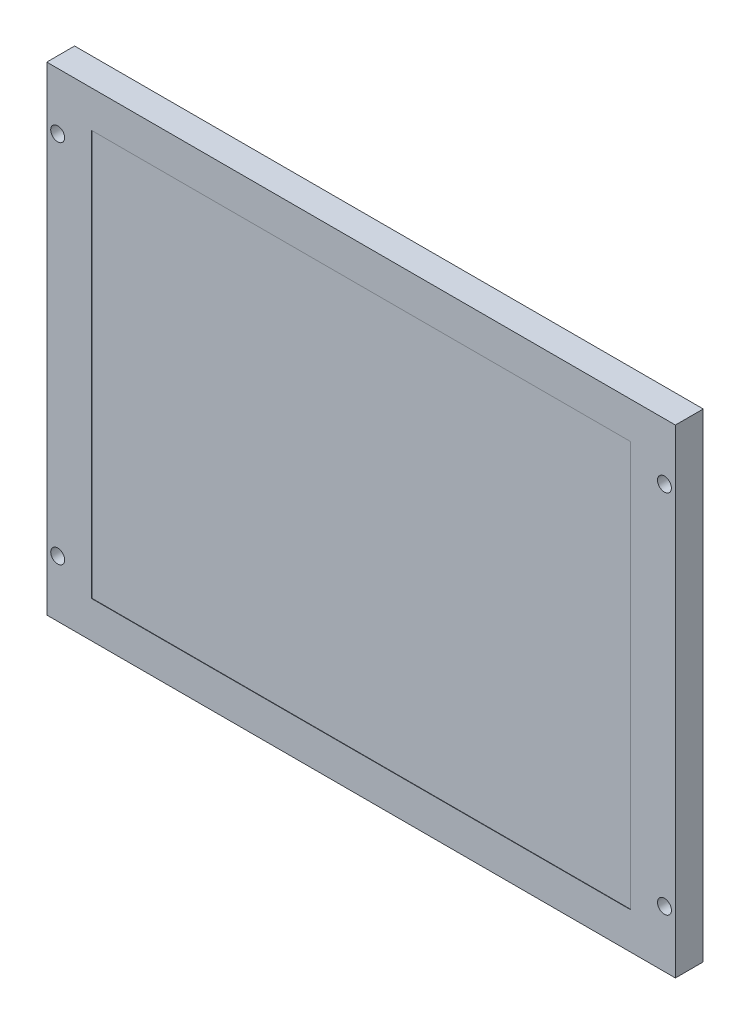
ISO-10303-21;
HEADER;
FILE_DESCRIPTION(('STEP AP214'),'2;1');
FILE_NAME('part.step','',(''),(''),'','','');
FILE_SCHEMA(('AUTOMOTIVE_DESIGN { 1 0 10303 214 1 1 1 1 }'));
ENDSEC;
DATA;
#1=APPLICATION_CONTEXT('core data for automotive mechanical design processes');
#2=APPLICATION_PROTOCOL_DEFINITION('international standard','automotive_design',2000,#1);
#3=PRODUCT_CONTEXT('',#1,'mechanical');
#4=PRODUCT('Part','Part','',(#3));
#5=PRODUCT_RELATED_PRODUCT_CATEGORY('part','',(#4));
#6=PRODUCT_DEFINITION_FORMATION('','',#4);
#7=PRODUCT_DEFINITION_CONTEXT('part definition',#1,'design');
#8=PRODUCT_DEFINITION('design','',#6,#7);
#9=PRODUCT_DEFINITION_SHAPE('','',#8);
#10=(LENGTH_UNIT() NAMED_UNIT(*) SI_UNIT(.MILLI.,.METRE.));
#11=(NAMED_UNIT(*) PLANE_ANGLE_UNIT() SI_UNIT($,.RADIAN.));
#12=(NAMED_UNIT(*) SI_UNIT($,.STERADIAN.) SOLID_ANGLE_UNIT());
#13=UNCERTAINTY_MEASURE_WITH_UNIT(LENGTH_MEASURE(1.E-05),#10,'distance_accuracy_value','');
#14=(GEOMETRIC_REPRESENTATION_CONTEXT(3) GLOBAL_UNCERTAINTY_ASSIGNED_CONTEXT((#13)) GLOBAL_UNIT_ASSIGNED_CONTEXT((#10,
#11,#12)) REPRESENTATION_CONTEXT('',''));
#15=CARTESIAN_POINT('',(0.,0.,0.));
#16=DIRECTION('',(0.,0.,1.));
#17=DIRECTION('',(1.,0.,0.));
#18=AXIS2_PLACEMENT_3D('',#15,#16,#17);
#19=CARTESIAN_POINT('',(0.,-120.36,0.));
#20=DIRECTION('',(0.,0.,1.));
#21=DIRECTION('',(1.,0.,0.));
#22=AXIS2_PLACEMENT_3D('',#19,#20,#21);
#23=PLANE('',#22);
#24=DIRECTION('',(0.,-1.,0.));
#25=VECTOR('',#24,1.);
#26=CARTESIAN_POINT('',(0.,0.,0.));
#27=LINE('',#26,#25);
#28=CARTESIAN_POINT('',(0.,0.,0.));
#29=VERTEX_POINT('',#28);
#30=CARTESIAN_POINT('',(0.,-120.36,0.));
#31=VERTEX_POINT('',#30);
#32=EDGE_CURVE('E191',#29,#31,#27,.T.);
#33=ORIENTED_EDGE('',*,*,#32,.F.);
#34=DIRECTION('',(-1.,0.,0.));
#35=VECTOR('',#34,1.);
#36=CARTESIAN_POINT('',(0.,0.,0.));
#37=LINE('',#36,#35);
#38=CARTESIAN_POINT('',(158.,0.,0.));
#39=VERTEX_POINT('',#38);
#40=EDGE_CURVE('E204',#39,#29,#37,.T.);
#41=ORIENTED_EDGE('',*,*,#40,.F.);
#42=DIRECTION('',(0.,1.,0.));
#43=VECTOR('',#42,1.);
#44=CARTESIAN_POINT('',(158.,0.,0.));
#45=LINE('',#44,#43);
#46=CARTESIAN_POINT('',(158.,-120.36,0.));
#47=VERTEX_POINT('',#46);
#48=EDGE_CURVE('E202',#47,#39,#45,.T.);
#49=ORIENTED_EDGE('',*,*,#48,.F.);
#50=DIRECTION('',(1.,0.,0.));
#51=VECTOR('',#50,1.);
#52=CARTESIAN_POINT('',(0.,-120.36,0.));
#53=LINE('',#52,#51);
#54=EDGE_CURVE('E200',#31,#47,#53,.T.);
#55=ORIENTED_EDGE('',*,*,#54,.F.);
#56=EDGE_LOOP('',(#33,#41,#49,#55));
#57=FACE_BOUND('',#56,.T.);
#58=CARTESIAN_POINT('',(155.25,-14.23,0.));
#59=DIRECTION('',(0.,0.,1.));
#60=DIRECTION('',(1.,0.,0.));
#61=AXIS2_PLACEMENT_3D('',#58,#59,#60);
#62=CIRCLE('',#61,1.75000000000001);
#63=CARTESIAN_POINT('',(157.,-14.23,0.));
#64=VERTEX_POINT('',#63);
#65=EDGE_CURVE('E164',#64,#64,#62,.T.);
#66=ORIENTED_EDGE('',*,*,#65,.T.);
#67=EDGE_LOOP('',(#66));
#68=FACE_BOUND('',#67,.T.);
#69=CARTESIAN_POINT('',(155.25,-106.13,0.));
#70=DIRECTION('',(0.,0.,1.));
#71=DIRECTION('',(1.,0.,0.));
#72=AXIS2_PLACEMENT_3D('',#69,#70,#71);
#73=CIRCLE('',#72,1.75000000000001);
#74=CARTESIAN_POINT('',(157.,-106.13,0.));
#75=VERTEX_POINT('',#74);
#76=EDGE_CURVE('E160',#75,#75,#73,.T.);
#77=ORIENTED_EDGE('',*,*,#76,.T.);
#78=EDGE_LOOP('',(#77));
#79=FACE_BOUND('',#78,.T.);
#80=CARTESIAN_POINT('',(2.75,-14.23,0.));
#81=DIRECTION('',(0.,0.,1.));
#82=DIRECTION('',(1.,0.,0.));
#83=AXIS2_PLACEMENT_3D('',#80,#81,#82);
#84=CIRCLE('',#83,1.75);
#85=CARTESIAN_POINT('',(4.5,-14.23,0.));
#86=VERTEX_POINT('',#85);
#87=EDGE_CURVE('E156',#86,#86,#84,.T.);
#88=ORIENTED_EDGE('',*,*,#87,.T.);
#89=EDGE_LOOP('',(#88));
#90=FACE_BOUND('',#89,.T.);
#91=CARTESIAN_POINT('',(2.74999999999999,-106.13,0.));
#92=DIRECTION('',(0.,0.,1.));
#93=DIRECTION('',(1.,0.,0.));
#94=AXIS2_PLACEMENT_3D('',#91,#92,#93);
#95=CIRCLE('',#94,1.75);
#96=CARTESIAN_POINT('',(4.49999999999999,-106.13,0.));
#97=VERTEX_POINT('',#96);
#98=EDGE_CURVE('E35',#97,#97,#95,.T.);
#99=ORIENTED_EDGE('',*,*,#98,.T.);
#100=EDGE_LOOP('',(#99));
#101=FACE_BOUND('',#100,.T.);
#102=DIRECTION('',(0.,-1.,0.));
#103=VECTOR('',#102,1.);
#104=CARTESIAN_POINT('',(142.57128982129,-75.8185081585081,0.));
#105=LINE('',#104,#103);
#106=CARTESIAN_POINT('',(142.57128982129,-75.8185081585081,0.));
#107=VERTEX_POINT('',#106);
#108=CARTESIAN_POINT('',(142.57128982129,-79.5014918414918,0.));
#109=VERTEX_POINT('',#108);
#110=EDGE_CURVE('E118',#107,#109,#105,.T.);
#111=ORIENTED_EDGE('',*,*,#110,.F.);
#112=DIRECTION('',(1.,0.,0.));
#113=VECTOR('',#112,1.);
#114=CARTESIAN_POINT('',(142.57128982129,-75.8185081585081,0.));
#115=LINE('',#114,#113);
#116=CARTESIAN_POINT('',(122.92871017871,-75.8185081585081,0.));
#117=VERTEX_POINT('',#116);
#118=EDGE_CURVE('E120',#117,#107,#115,.T.);
#119=ORIENTED_EDGE('',*,*,#118,.F.);
#120=DIRECTION('',(0.,1.,0.));
#121=VECTOR('',#120,1.);
#122=CARTESIAN_POINT('',(122.92871017871,-75.8185081585081,0.));
#123=LINE('',#122,#121);
#124=CARTESIAN_POINT('',(122.92871017871,-79.5014918414918,0.));
#125=VERTEX_POINT('',#124);
#126=EDGE_CURVE('E53',#125,#117,#123,.T.);
#127=ORIENTED_EDGE('',*,*,#126,.F.);
#128=DIRECTION('',(-1.,0.,0.));
#129=VECTOR('',#128,1.);
#130=CARTESIAN_POINT('',(142.57128982129,-79.5014918414918,0.));
#131=LINE('',#130,#129);
#132=EDGE_CURVE('E48',#109,#125,#131,.T.);
#133=ORIENTED_EDGE('',*,*,#132,.F.);
#134=EDGE_LOOP('',(#111,#119,#127,#133));
#135=FACE_BOUND('',#134,.T.);
#136=ADVANCED_FACE('F31',(#57,#68,#79,#90,#101,#135),#23,.F.);
#137=CARTESIAN_POINT('',(0.,0.,7.));
#138=DIRECTION('',(1.,0.,0.));
#139=DIRECTION('',(0.,1.,0.));
#140=AXIS2_PLACEMENT_3D('',#137,#138,#139);
#141=PLANE('',#140);
#142=ORIENTED_EDGE('',*,*,#32,.T.);
#143=DIRECTION('',(0.,0.,-1.));
#144=VECTOR('',#143,1.);
#145=CARTESIAN_POINT('',(0.,-120.36,7.));
#146=LINE('',#145,#144);
#147=CARTESIAN_POINT('',(0.,-120.36,7.));
#148=VERTEX_POINT('',#147);
#149=EDGE_CURVE('E11',#148,#31,#146,.T.);
#150=ORIENTED_EDGE('',*,*,#149,.F.);
#151=DIRECTION('',(0.,-1.,0.));
#152=VECTOR('',#151,1.);
#153=CARTESIAN_POINT('',(0.,0.,7.));
#154=LINE('',#153,#152);
#155=CARTESIAN_POINT('',(0.,0.,7.));
#156=VERTEX_POINT('',#155);
#157=EDGE_CURVE('E206',#156,#148,#154,.T.);
#158=ORIENTED_EDGE('',*,*,#157,.F.);
#159=DIRECTION('',(0.,0.,-1.));
#160=VECTOR('',#159,1.);
#161=CARTESIAN_POINT('',(0.,0.,7.));
#162=LINE('',#161,#160);
#163=EDGE_CURVE('E215',#156,#29,#162,.T.);
#164=ORIENTED_EDGE('',*,*,#163,.T.);
#165=EDGE_LOOP('',(#142,#150,#158,#164));
#166=FACE_BOUND('',#165,.T.);
#167=ADVANCED_FACE('F33',(#166),#141,.F.);
#168=CARTESIAN_POINT('',(0.,-120.36,7.));
#169=DIRECTION('',(0.,1.,0.));
#170=DIRECTION('',(0.,0.,1.));
#171=AXIS2_PLACEMENT_3D('',#168,#169,#170);
#172=PLANE('',#171);
#173=ORIENTED_EDGE('',*,*,#54,.T.);
#174=DIRECTION('',(0.,0.,-1.));
#175=VECTOR('',#174,1.);
#176=CARTESIAN_POINT('',(158.,-120.36,7.));
#177=LINE('',#176,#175);
#178=CARTESIAN_POINT('',(158.,-120.36,7.));
#179=VERTEX_POINT('',#178);
#180=EDGE_CURVE('E40',#179,#47,#177,.T.);
#181=ORIENTED_EDGE('',*,*,#180,.F.);
#182=DIRECTION('',(1.,0.,0.));
#183=VECTOR('',#182,1.);
#184=CARTESIAN_POINT('',(0.,-120.36,7.));
#185=LINE('',#184,#183);
#186=EDGE_CURVE('E209',#148,#179,#185,.T.);
#187=ORIENTED_EDGE('',*,*,#186,.F.);
#188=ORIENTED_EDGE('',*,*,#149,.T.);
#189=EDGE_LOOP('',(#173,#181,#187,#188));
#190=FACE_BOUND('',#189,.T.);
#191=ADVANCED_FACE('F252',(#190),#172,.F.);
#192=CARTESIAN_POINT('',(158.,0.,7.));
#193=DIRECTION('',(-1.,0.,0.));
#194=DIRECTION('',(0.,-1.,0.));
#195=AXIS2_PLACEMENT_3D('',#192,#193,#194);
#196=PLANE('',#195);
#197=ORIENTED_EDGE('',*,*,#48,.T.);
#198=DIRECTION('',(0.,0.,-1.));
#199=VECTOR('',#198,1.);
#200=CARTESIAN_POINT('',(158.,0.,7.));
#201=LINE('',#200,#199);
#202=CARTESIAN_POINT('',(158.,0.,7.));
#203=VERTEX_POINT('',#202);
#204=EDGE_CURVE('E218',#203,#39,#201,.T.);
#205=ORIENTED_EDGE('',*,*,#204,.F.);
#206=DIRECTION('',(0.,1.,0.));
#207=VECTOR('',#206,1.);
#208=CARTESIAN_POINT('',(158.,0.,7.));
#209=LINE('',#208,#207);
#210=EDGE_CURVE('E211',#179,#203,#209,.T.);
#211=ORIENTED_EDGE('',*,*,#210,.F.);
#212=ORIENTED_EDGE('',*,*,#180,.T.);
#213=EDGE_LOOP('',(#197,#205,#211,#212));
#214=FACE_BOUND('',#213,.T.);
#215=ADVANCED_FACE('F267',(#214),#196,.F.);
#216=CARTESIAN_POINT('',(0.,0.,7.));
#217=DIRECTION('',(0.,-1.,0.));
#218=DIRECTION('',(0.,0.,-1.));
#219=AXIS2_PLACEMENT_3D('',#216,#217,#218);
#220=PLANE('',#219);
#221=ORIENTED_EDGE('',*,*,#40,.T.);
#222=ORIENTED_EDGE('',*,*,#163,.F.);
#223=DIRECTION('',(-1.,0.,0.));
#224=VECTOR('',#223,1.);
#225=CARTESIAN_POINT('',(0.,0.,7.));
#226=LINE('',#225,#224);
#227=EDGE_CURVE('E213',#203,#156,#226,.T.);
#228=ORIENTED_EDGE('',*,*,#227,.F.);
#229=ORIENTED_EDGE('',*,*,#204,.T.);
#230=EDGE_LOOP('',(#221,#222,#228,#229));
#231=FACE_BOUND('',#230,.T.);
#232=ADVANCED_FACE('F263',(#231),#220,.F.);
#233=CARTESIAN_POINT('',(0.,-120.36,7.));
#234=DIRECTION('',(0.,0.,1.));
#235=DIRECTION('',(1.,0.,0.));
#236=AXIS2_PLACEMENT_3D('',#233,#234,#235);
#237=PLANE('',#236);
#238=CARTESIAN_POINT('',(2.74999999999999,-106.13,7.));
#239=DIRECTION('',(0.,0.,1.));
#240=DIRECTION('',(1.,0.,0.));
#241=AXIS2_PLACEMENT_3D('',#238,#239,#240);
#242=CIRCLE('',#241,1.75);
#243=CARTESIAN_POINT('',(4.49999999999999,-106.13,7.));
#244=VERTEX_POINT('',#243);
#245=EDGE_CURVE('E150',#244,#244,#242,.T.);
#246=ORIENTED_EDGE('',*,*,#245,.F.);
#247=EDGE_LOOP('',(#246));
#248=FACE_BOUND('',#247,.T.);
#249=CARTESIAN_POINT('',(2.75,-14.23,7.));
#250=DIRECTION('',(0.,0.,1.));
#251=DIRECTION('',(1.,0.,0.));
#252=AXIS2_PLACEMENT_3D('',#249,#250,#251);
#253=CIRCLE('',#252,1.75);
#254=CARTESIAN_POINT('',(4.5,-14.23,7.));
#255=VERTEX_POINT('',#254);
#256=EDGE_CURVE('E153',#255,#255,#253,.T.);
#257=ORIENTED_EDGE('',*,*,#256,.F.);
#258=EDGE_LOOP('',(#257));
#259=FACE_BOUND('',#258,.T.);
#260=CARTESIAN_POINT('',(155.25,-106.13,7.));
#261=DIRECTION('',(0.,0.,1.));
#262=DIRECTION('',(1.,0.,0.));
#263=AXIS2_PLACEMENT_3D('',#260,#261,#262);
#264=CIRCLE('',#263,1.75000000000001);
#265=CARTESIAN_POINT('',(157.,-106.13,7.));
#266=VERTEX_POINT('',#265);
#267=EDGE_CURVE('E157',#266,#266,#264,.T.);
#268=ORIENTED_EDGE('',*,*,#267,.F.);
#269=EDGE_LOOP('',(#268));
#270=FACE_BOUND('',#269,.T.);
#271=CARTESIAN_POINT('',(155.25,-14.23,7.));
#272=DIRECTION('',(0.,0.,1.));
#273=DIRECTION('',(1.,0.,0.));
#274=AXIS2_PLACEMENT_3D('',#271,#272,#273);
#275=CIRCLE('',#274,1.75000000000001);
#276=CARTESIAN_POINT('',(157.,-14.23,7.));
#277=VERTEX_POINT('',#276);
#278=EDGE_CURVE('E161',#277,#277,#275,.T.);
#279=ORIENTED_EDGE('',*,*,#278,.F.);
#280=EDGE_LOOP('',(#279));
#281=FACE_BOUND('',#280,.T.);
#282=DIRECTION('',(0.,-1.,0.));
#283=VECTOR('',#282,1.);
#284=CARTESIAN_POINT('',(11.27,-9.23,7.));
#285=LINE('',#284,#283);
#286=CARTESIAN_POINT('',(11.27,-9.23,7.));
#287=VERTEX_POINT('',#286);
#288=CARTESIAN_POINT('',(11.27,-111.13,7.));
#289=VERTEX_POINT('',#288);
#290=EDGE_CURVE('E165',#287,#289,#285,.T.);
#291=ORIENTED_EDGE('',*,*,#290,.F.);
#292=DIRECTION('',(-1.,0.,0.));
#293=VECTOR('',#292,1.);
#294=CARTESIAN_POINT('',(11.27,-9.23,7.));
#295=LINE('',#294,#293);
#296=CARTESIAN_POINT('',(146.73,-9.23,7.));
#297=VERTEX_POINT('',#296);
#298=EDGE_CURVE('E173',#297,#287,#295,.T.);
#299=ORIENTED_EDGE('',*,*,#298,.F.);
#300=DIRECTION('',(0.,1.,0.));
#301=VECTOR('',#300,1.);
#302=CARTESIAN_POINT('',(146.73,-9.23,7.));
#303=LINE('',#302,#301);
#304=CARTESIAN_POINT('',(146.73,-111.13,7.));
#305=VERTEX_POINT('',#304);
#306=EDGE_CURVE('E170',#305,#297,#303,.T.);
#307=ORIENTED_EDGE('',*,*,#306,.F.);
#308=DIRECTION('',(1.,0.,0.));
#309=VECTOR('',#308,1.);
#310=CARTESIAN_POINT('',(11.27,-111.13,7.));
#311=LINE('',#310,#309);
#312=EDGE_CURVE('E167',#289,#305,#311,.T.);
#313=ORIENTED_EDGE('',*,*,#312,.F.);
#314=EDGE_LOOP('',(#291,#299,#307,#313));
#315=FACE_BOUND('',#314,.T.);
#316=ORIENTED_EDGE('',*,*,#157,.T.);
#317=ORIENTED_EDGE('',*,*,#186,.T.);
#318=ORIENTED_EDGE('',*,*,#210,.T.);
#319=ORIENTED_EDGE('',*,*,#227,.T.);
#320=EDGE_LOOP('',(#316,#317,#318,#319));
#321=FACE_BOUND('',#320,.T.);
#322=ADVANCED_FACE('F260',(#248,#259,#270,#281,#315,#321),#237,.T.);
#323=CARTESIAN_POINT('',(11.27,-9.23,6.9));
#324=DIRECTION('',(-1.,0.,0.));
#325=DIRECTION('',(0.,-1.,0.));
#326=AXIS2_PLACEMENT_3D('',#323,#324,#325);
#327=PLANE('',#326);
#328=ORIENTED_EDGE('',*,*,#290,.T.);
#329=DIRECTION('',(0.,0.,1.));
#330=VECTOR('',#329,1.);
#331=CARTESIAN_POINT('',(11.27,-111.13,6.9));
#332=LINE('',#331,#330);
#333=CARTESIAN_POINT('',(11.27,-111.13,6.9));
#334=VERTEX_POINT('',#333);
#335=EDGE_CURVE('E188',#334,#289,#332,.T.);
#336=ORIENTED_EDGE('',*,*,#335,.F.);
#337=DIRECTION('',(0.,-1.,0.));
#338=VECTOR('',#337,1.);
#339=CARTESIAN_POINT('',(11.27,-9.23,6.9));
#340=LINE('',#339,#338);
#341=CARTESIAN_POINT('',(11.27,-9.23,6.9));
#342=VERTEX_POINT('',#341);
#343=EDGE_CURVE('E176',#342,#334,#340,.T.);
#344=ORIENTED_EDGE('',*,*,#343,.F.);
#345=DIRECTION('',(0.,0.,1.));
#346=VECTOR('',#345,1.);
#347=CARTESIAN_POINT('',(11.27,-9.23,6.9));
#348=LINE('',#347,#346);
#349=EDGE_CURVE('E189',#342,#287,#348,.T.);
#350=ORIENTED_EDGE('',*,*,#349,.T.);
#351=EDGE_LOOP('',(#328,#336,#344,#350));
#352=FACE_BOUND('',#351,.T.);
#353=ADVANCED_FACE('F258',(#352),#327,.F.);
#354=CARTESIAN_POINT('',(11.27,-9.23,6.9));
#355=DIRECTION('',(0.,1.,0.));
#356=DIRECTION('',(0.,0.,1.));
#357=AXIS2_PLACEMENT_3D('',#354,#355,#356);
#358=PLANE('',#357);
#359=ORIENTED_EDGE('',*,*,#298,.T.);
#360=ORIENTED_EDGE('',*,*,#349,.F.);
#361=DIRECTION('',(-1.,0.,0.));
#362=VECTOR('',#361,1.);
#363=CARTESIAN_POINT('',(11.27,-9.23,6.9));
#364=LINE('',#363,#362);
#365=CARTESIAN_POINT('',(146.73,-9.23,6.9));
#366=VERTEX_POINT('',#365);
#367=EDGE_CURVE('E185',#366,#342,#364,.T.);
#368=ORIENTED_EDGE('',*,*,#367,.F.);
#369=DIRECTION('',(0.,0.,1.));
#370=VECTOR('',#369,1.);
#371=CARTESIAN_POINT('',(146.73,-9.23,6.9));
#372=LINE('',#371,#370);
#373=EDGE_CURVE('E192',#366,#297,#372,.T.);
#374=ORIENTED_EDGE('',*,*,#373,.T.);
#375=EDGE_LOOP('',(#359,#360,#368,#374));
#376=FACE_BOUND('',#375,.T.);
#377=ADVANCED_FACE('F307',(#376),#358,.F.);
#378=CARTESIAN_POINT('',(146.73,-9.23,6.9));
#379=DIRECTION('',(1.,0.,0.));
#380=DIRECTION('',(0.,0.,-1.));
#381=AXIS2_PLACEMENT_3D('',#378,#379,#380);
#382=PLANE('',#381);
#383=ORIENTED_EDGE('',*,*,#306,.T.);
#384=ORIENTED_EDGE('',*,*,#373,.F.);
#385=DIRECTION('',(0.,1.,0.));
#386=VECTOR('',#385,1.);
#387=CARTESIAN_POINT('',(146.73,-9.23,6.9));
#388=LINE('',#387,#386);
#389=CARTESIAN_POINT('',(146.73,-111.13,6.9));
#390=VERTEX_POINT('',#389);
#391=EDGE_CURVE('E182',#390,#366,#388,.T.);
#392=ORIENTED_EDGE('',*,*,#391,.F.);
#393=DIRECTION('',(0.,0.,1.));
#394=VECTOR('',#393,1.);
#395=CARTESIAN_POINT('',(146.73,-111.13,6.9));
#396=LINE('',#395,#394);
#397=EDGE_CURVE('E194',#390,#305,#396,.T.);
#398=ORIENTED_EDGE('',*,*,#397,.T.);
#399=EDGE_LOOP('',(#383,#384,#392,#398));
#400=FACE_BOUND('',#399,.T.);
#401=ADVANCED_FACE('F314',(#400),#382,.F.);
#402=CARTESIAN_POINT('',(11.27,-111.13,6.9));
#403=DIRECTION('',(0.,-1.,0.));
#404=DIRECTION('',(0.,0.,-1.));
#405=AXIS2_PLACEMENT_3D('',#402,#403,#404);
#406=PLANE('',#405);
#407=ORIENTED_EDGE('',*,*,#312,.T.);
#408=ORIENTED_EDGE('',*,*,#397,.F.);
#409=DIRECTION('',(1.,0.,0.));
#410=VECTOR('',#409,1.);
#411=CARTESIAN_POINT('',(11.27,-111.13,6.9));
#412=LINE('',#411,#410);
#413=EDGE_CURVE('E179',#334,#390,#412,.T.);
#414=ORIENTED_EDGE('',*,*,#413,.F.);
#415=ORIENTED_EDGE('',*,*,#335,.T.);
#416=EDGE_LOOP('',(#407,#408,#414,#415));
#417=FACE_BOUND('',#416,.T.);
#418=ADVANCED_FACE('F322',(#417),#406,.F.);
#419=CARTESIAN_POINT('',(11.27,-111.13,6.9));
#420=DIRECTION('',(0.,0.,1.));
#421=DIRECTION('',(1.,0.,0.));
#422=AXIS2_PLACEMENT_3D('',#419,#420,#421);
#423=PLANE('',#422);
#424=ORIENTED_EDGE('',*,*,#343,.T.);
#425=ORIENTED_EDGE('',*,*,#413,.T.);
#426=ORIENTED_EDGE('',*,*,#391,.T.);
#427=ORIENTED_EDGE('',*,*,#367,.T.);
#428=EDGE_LOOP('',(#424,#425,#426,#427));
#429=FACE_BOUND('',#428,.T.);
#430=ADVANCED_FACE('F330',(#429),#423,.T.);
#431=CARTESIAN_POINT('',(155.25,-14.23,-3.));
#432=DIRECTION('',(0.,0.,1.));
#433=DIRECTION('',(1.,0.,0.));
#434=AXIS2_PLACEMENT_3D('',#431,#432,#433);
#435=CYLINDRICAL_SURFACE('',#434,1.75000000000001);
#436=ORIENTED_EDGE('',*,*,#278,.T.);
#437=EDGE_LOOP('',(#436));
#438=FACE_BOUND('',#437,.T.);
#439=ORIENTED_EDGE('',*,*,#65,.F.);
#440=EDGE_LOOP('',(#439));
#441=FACE_BOUND('',#440,.T.);
#442=ADVANCED_FACE('F243',(#438,#441),#435,.F.);
#443=CARTESIAN_POINT('',(155.25,-106.13,-3.));
#444=DIRECTION('',(0.,0.,1.));
#445=DIRECTION('',(1.,0.,0.));
#446=AXIS2_PLACEMENT_3D('',#443,#444,#445);
#447=CYLINDRICAL_SURFACE('',#446,1.75000000000001);
#448=ORIENTED_EDGE('',*,*,#267,.T.);
#449=EDGE_LOOP('',(#448));
#450=FACE_BOUND('',#449,.T.);
#451=ORIENTED_EDGE('',*,*,#76,.F.);
#452=EDGE_LOOP('',(#451));
#453=FACE_BOUND('',#452,.T.);
#454=ADVANCED_FACE('F234',(#450,#453),#447,.F.);
#455=CARTESIAN_POINT('',(2.75,-14.23,-3.));
#456=DIRECTION('',(0.,0.,1.));
#457=DIRECTION('',(1.,0.,0.));
#458=AXIS2_PLACEMENT_3D('',#455,#456,#457);
#459=CYLINDRICAL_SURFACE('',#458,1.75);
#460=ORIENTED_EDGE('',*,*,#256,.T.);
#461=EDGE_LOOP('',(#460));
#462=FACE_BOUND('',#461,.T.);
#463=ORIENTED_EDGE('',*,*,#87,.F.);
#464=EDGE_LOOP('',(#463));
#465=FACE_BOUND('',#464,.T.);
#466=ADVANCED_FACE('F231',(#462,#465),#459,.F.);
#467=CARTESIAN_POINT('',(2.74999999999999,-106.13,-3.));
#468=DIRECTION('',(0.,0.,1.));
#469=DIRECTION('',(1.,0.,0.));
#470=AXIS2_PLACEMENT_3D('',#467,#468,#469);
#471=CYLINDRICAL_SURFACE('',#470,1.75);
#472=ORIENTED_EDGE('',*,*,#245,.T.);
#473=EDGE_LOOP('',(#472));
#474=FACE_BOUND('',#473,.T.);
#475=ORIENTED_EDGE('',*,*,#98,.F.);
#476=EDGE_LOOP('',(#475));
#477=FACE_BOUND('',#476,.T.);
#478=ADVANCED_FACE('F233',(#474,#477),#471,.F.);
#479=CARTESIAN_POINT('',(142.57128982129,-75.8185081585081,-3.75));
#480=DIRECTION('',(-1.,0.,0.));
#481=DIRECTION('',(0.,0.,1.));
#482=AXIS2_PLACEMENT_3D('',#479,#480,#481);
#483=PLANE('',#482);
#484=ORIENTED_EDGE('',*,*,#110,.T.);
#485=DIRECTION('',(0.,0.,1.));
#486=VECTOR('',#485,1.);
#487=CARTESIAN_POINT('',(142.57128982129,-79.5014918414918,-3.75));
#488=LINE('',#487,#486);
#489=CARTESIAN_POINT('',(142.57128982129,-79.5014918414918,-3.75));
#490=VERTEX_POINT('',#489);
#491=EDGE_CURVE('E148',#490,#109,#488,.T.);
#492=ORIENTED_EDGE('',*,*,#491,.F.);
#493=DIRECTION('',(0.,-1.,0.));
#494=VECTOR('',#493,1.);
#495=CARTESIAN_POINT('',(142.57128982129,-75.8185081585081,-3.75));
#496=LINE('',#495,#494);
#497=CARTESIAN_POINT('',(142.57128982129,-75.8185081585081,-3.75));
#498=VERTEX_POINT('',#497);
#499=EDGE_CURVE('E134',#498,#490,#496,.T.);
#500=ORIENTED_EDGE('',*,*,#499,.F.);
#501=DIRECTION('',(0.,0.,1.));
#502=VECTOR('',#501,1.);
#503=CARTESIAN_POINT('',(142.57128982129,-75.8185081585081,-3.75));
#504=LINE('',#503,#502);
#505=EDGE_CURVE('E130',#498,#107,#504,.T.);
#506=ORIENTED_EDGE('',*,*,#505,.T.);
#507=EDGE_LOOP('',(#484,#492,#500,#506));
#508=FACE_BOUND('',#507,.T.);
#509=ADVANCED_FACE('F136',(#508),#483,.F.);
#510=CARTESIAN_POINT('',(142.57128982129,-79.5014918414918,-3.75));
#511=DIRECTION('',(0.,1.,0.));
#512=DIRECTION('',(0.,0.,1.));
#513=AXIS2_PLACEMENT_3D('',#510,#511,#512);
#514=PLANE('',#513);
#515=ORIENTED_EDGE('',*,*,#132,.T.);
#516=DIRECTION('',(0.,0.,1.));
#517=VECTOR('',#516,1.);
#518=CARTESIAN_POINT('',(122.92871017871,-79.5014918414918,-3.75));
#519=LINE('',#518,#517);
#520=CARTESIAN_POINT('',(122.92871017871,-79.5014918414918,-3.75));
#521=VERTEX_POINT('',#520);
#522=EDGE_CURVE('E140',#521,#125,#519,.T.);
#523=ORIENTED_EDGE('',*,*,#522,.F.);
#524=DIRECTION('',(-1.,0.,0.));
#525=VECTOR('',#524,1.);
#526=CARTESIAN_POINT('',(142.57128982129,-79.5014918414918,-3.75));
#527=LINE('',#526,#525);
#528=EDGE_CURVE('E411',#490,#521,#527,.T.);
#529=ORIENTED_EDGE('',*,*,#528,.F.);
#530=ORIENTED_EDGE('',*,*,#491,.T.);
#531=EDGE_LOOP('',(#515,#523,#529,#530));
#532=FACE_BOUND('',#531,.T.);
#533=ADVANCED_FACE('F370',(#532),#514,.F.);
#534=CARTESIAN_POINT('',(122.92871017871,-75.8185081585081,-3.75));
#535=DIRECTION('',(1.,0.,0.));
#536=DIRECTION('',(0.,0.,-1.));
#537=AXIS2_PLACEMENT_3D('',#534,#535,#536);
#538=PLANE('',#537);
#539=ORIENTED_EDGE('',*,*,#126,.T.);
#540=DIRECTION('',(0.,0.,1.));
#541=VECTOR('',#540,1.);
#542=CARTESIAN_POINT('',(122.92871017871,-75.8185081585081,-3.75));
#543=LINE('',#542,#541);
#544=CARTESIAN_POINT('',(122.92871017871,-75.8185081585081,-3.75));
#545=VERTEX_POINT('',#544);
#546=EDGE_CURVE('E133',#545,#117,#543,.T.);
#547=ORIENTED_EDGE('',*,*,#546,.F.);
#548=DIRECTION('',(0.,1.,0.));
#549=VECTOR('',#548,1.);
#550=CARTESIAN_POINT('',(122.92871017871,-75.8185081585081,-3.75));
#551=LINE('',#550,#549);
#552=EDGE_CURVE('E142',#521,#545,#551,.T.);
#553=ORIENTED_EDGE('',*,*,#552,.F.);
#554=ORIENTED_EDGE('',*,*,#522,.T.);
#555=EDGE_LOOP('',(#539,#547,#553,#554));
#556=FACE_BOUND('',#555,.T.);
#557=ADVANCED_FACE('F379',(#556),#538,.F.);
#558=CARTESIAN_POINT('',(142.57128982129,-75.8185081585081,-3.75));
#559=DIRECTION('',(0.,-1.,0.));
#560=DIRECTION('',(0.,0.,-1.));
#561=AXIS2_PLACEMENT_3D('',#558,#559,#560);
#562=PLANE('',#561);
#563=ORIENTED_EDGE('',*,*,#118,.T.);
#564=ORIENTED_EDGE('',*,*,#505,.F.);
#565=DIRECTION('',(1.,0.,0.));
#566=VECTOR('',#565,1.);
#567=CARTESIAN_POINT('',(142.57128982129,-75.8185081585081,-3.75));
#568=LINE('',#567,#566);
#569=EDGE_CURVE('E138',#545,#498,#568,.T.);
#570=ORIENTED_EDGE('',*,*,#569,.F.);
#571=ORIENTED_EDGE('',*,*,#546,.T.);
#572=EDGE_LOOP('',(#563,#564,#570,#571));
#573=FACE_BOUND('',#572,.T.);
#574=ADVANCED_FACE('F128',(#573),#562,.F.);
#575=CARTESIAN_POINT('',(142.57128982129,-79.5014918414918,-3.75));
#576=DIRECTION('',(0.,0.,-1.));
#577=DIRECTION('',(-1.,0.,0.));
#578=AXIS2_PLACEMENT_3D('',#575,#576,#577);
#579=PLANE('',#578);
#580=ORIENTED_EDGE('',*,*,#499,.T.);
#581=ORIENTED_EDGE('',*,*,#528,.T.);
#582=ORIENTED_EDGE('',*,*,#552,.T.);
#583=ORIENTED_EDGE('',*,*,#569,.T.);
#584=EDGE_LOOP('',(#580,#581,#582,#583));
#585=FACE_BOUND('',#584,.T.);
#586=ADVANCED_FACE('F398',(#585),#579,.T.);
#587=CLOSED_SHELL('',(#136,#167,#191,#215,#232,#322,#353,#377,#401,#418,#430,#442,#454,#466,
#478,#509,#533,#557,#574,#586));
#588=MANIFOLD_SOLID_BREP('B2',#587);
#589=ADVANCED_BREP_SHAPE_REPRESENTATION('',(#18,#588),#14);
#590=SHAPE_DEFINITION_REPRESENTATION(#9,#589);
ENDSEC;
END-ISO-10303-21;
